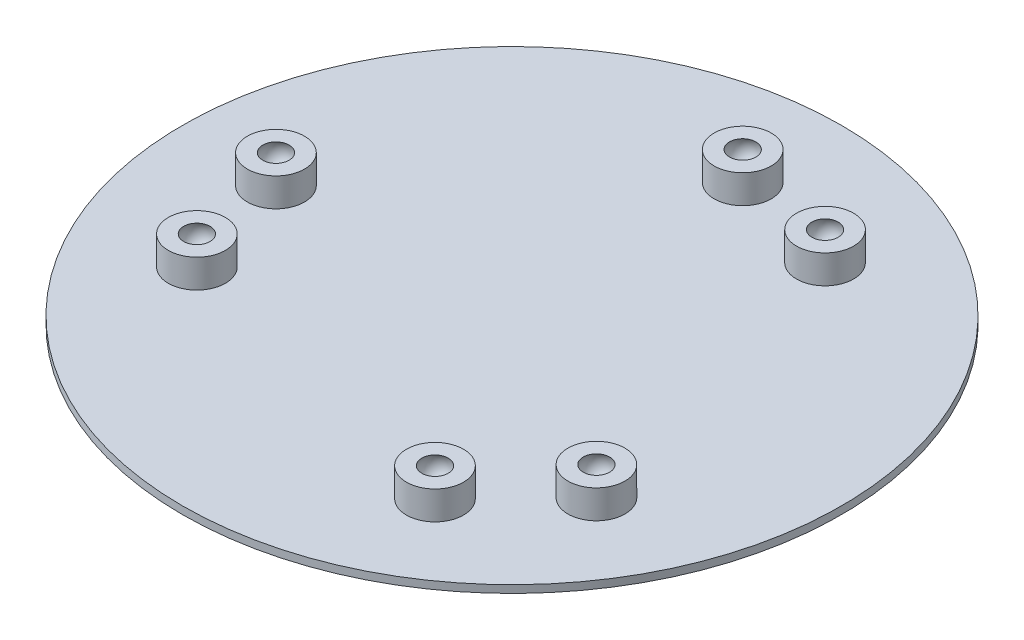
ISO-10303-21;
HEADER;
FILE_DESCRIPTION(('STEP AP214'),'2;1');
FILE_NAME('part.step','',(''),(''),'','','');
FILE_SCHEMA(('AUTOMOTIVE_DESIGN { 1 0 10303 214 1 1 1 1 }'));
ENDSEC;
DATA;
#1=APPLICATION_CONTEXT('core data for automotive mechanical design processes');
#2=APPLICATION_PROTOCOL_DEFINITION('international standard','automotive_design',2000,#1);
#3=PRODUCT_CONTEXT('',#1,'mechanical');
#4=PRODUCT('Part','Part','',(#3));
#5=PRODUCT_RELATED_PRODUCT_CATEGORY('part','',(#4));
#6=PRODUCT_DEFINITION_FORMATION('','',#4);
#7=PRODUCT_DEFINITION_CONTEXT('part definition',#1,'design');
#8=PRODUCT_DEFINITION('design','',#6,#7);
#9=PRODUCT_DEFINITION_SHAPE('','',#8);
#10=(LENGTH_UNIT() NAMED_UNIT(*) SI_UNIT(.MILLI.,.METRE.));
#11=(NAMED_UNIT(*) PLANE_ANGLE_UNIT() SI_UNIT($,.RADIAN.));
#12=(NAMED_UNIT(*) SI_UNIT($,.STERADIAN.) SOLID_ANGLE_UNIT());
#13=UNCERTAINTY_MEASURE_WITH_UNIT(LENGTH_MEASURE(1.E-05),#10,'distance_accuracy_value','');
#14=(GEOMETRIC_REPRESENTATION_CONTEXT(3) GLOBAL_UNCERTAINTY_ASSIGNED_CONTEXT((#13)) GLOBAL_UNIT_ASSIGNED_CONTEXT((#10,
#11,#12)) REPRESENTATION_CONTEXT('',''));
#15=CARTESIAN_POINT('',(0.,0.,0.));
#16=DIRECTION('',(0.,0.,1.));
#17=DIRECTION('',(1.,0.,0.));
#18=AXIS2_PLACEMENT_3D('',#15,#16,#17);
#19=CARTESIAN_POINT('',(0.,-20.,0.));
#20=DIRECTION('',(0.,1.,0.));
#21=DIRECTION('',(0.,0.,1.));
#22=AXIS2_PLACEMENT_3D('',#19,#20,#21);
#23=CYLINDRICAL_SURFACE('',#22,866.025405);
#24=CARTESIAN_POINT('',(0.,-20.,0.));
#25=DIRECTION('',(0.,1.,0.));
#26=DIRECTION('',(0.,0.,1.));
#27=AXIS2_PLACEMENT_3D('',#24,#25,#26);
#28=CIRCLE('',#27,866.025405);
#29=CARTESIAN_POINT('',(0.,-20.,866.025405));
#30=VERTEX_POINT('',#29);
#31=EDGE_CURVE('E11',#30,#30,#28,.T.);
#32=ORIENTED_EDGE('',*,*,#31,.T.);
#33=EDGE_LOOP('',(#32));
#34=FACE_BOUND('',#33,.T.);
#35=CARTESIAN_POINT('',(0.,0.,0.));
#36=DIRECTION('',(0.,1.,0.));
#37=DIRECTION('',(0.,0.,1.));
#38=AXIS2_PLACEMENT_3D('',#35,#36,#37);
#39=CIRCLE('',#38,866.025405);
#40=CARTESIAN_POINT('',(0.,0.,866.025405));
#41=VERTEX_POINT('',#40);
#42=EDGE_CURVE('E44',#41,#41,#39,.T.);
#43=ORIENTED_EDGE('',*,*,#42,.F.);
#44=EDGE_LOOP('',(#43));
#45=FACE_BOUND('',#44,.T.);
#46=ADVANCED_FACE('F41',(#34,#45),#23,.T.);
#47=CARTESIAN_POINT('',(0.,-20.,0.));
#48=DIRECTION('',(0.,1.,0.));
#49=DIRECTION('',(0.,0.,1.));
#50=AXIS2_PLACEMENT_3D('',#47,#48,#49);
#51=PLANE('',#50);
#52=ORIENTED_EDGE('',*,*,#31,.F.);
#53=EDGE_LOOP('',(#52));
#54=FACE_BOUND('',#53,.T.);
#55=ADVANCED_FACE('F143',(#54),#51,.F.);
#56=CARTESIAN_POINT('',(0.,0.,0.));
#57=DIRECTION('',(0.,1.,0.));
#58=DIRECTION('',(0.,0.,1.));
#59=AXIS2_PLACEMENT_3D('',#56,#57,#58);
#60=PLANE('',#59);
#61=CARTESIAN_POINT('',(-606.049929050178,0.,14.2648003782662));
#62=DIRECTION('',(0.,1.,0.));
#63=DIRECTION('',(0.,0.,1.));
#64=AXIS2_PLACEMENT_3D('',#61,#62,#63);
#65=CIRCLE('',#64,74.9999999999999);
#66=CARTESIAN_POINT('',(-606.049929050178,0.,89.2648003782662));
#67=VERTEX_POINT('',#66);
#68=EDGE_CURVE('E75',#67,#67,#65,.T.);
#69=ORIENTED_EDGE('',*,*,#68,.F.);
#70=EDGE_LOOP('',(#69));
#71=FACE_BOUND('',#70,.T.);
#72=CARTESIAN_POINT('',(-525.000000736815,0.,303.108891750063));
#73=DIRECTION('',(0.,1.,0.));
#74=DIRECTION('',(0.,0.,1.));
#75=AXIS2_PLACEMENT_3D('',#72,#73,#74);
#76=CIRCLE('',#75,75.);
#77=CARTESIAN_POINT('',(-525.000000736815,0.,378.108891750063));
#78=VERTEX_POINT('',#77);
#79=EDGE_CURVE('E71',#78,#78,#76,.T.);
#80=ORIENTED_EDGE('',*,*,#79,.F.);
#81=EDGE_LOOP('',(#80));
#82=FACE_BOUND('',#81,.T.);
#83=CARTESIAN_POINT('',(315.378644032661,0.,517.72223433014));
#84=DIRECTION('',(0.,1.,0.));
#85=DIRECTION('',(0.,0.,1.));
#86=AXIS2_PLACEMENT_3D('',#83,#84,#85);
#87=CIRCLE('',#86,75.);
#88=CARTESIAN_POINT('',(315.378644032661,0.,592.72223433014));
#89=VERTEX_POINT('',#88);
#90=EDGE_CURVE('E67',#89,#89,#87,.T.);
#91=ORIENTED_EDGE('',*,*,#90,.F.);
#92=EDGE_LOOP('',(#91));
#93=FACE_BOUND('',#92,.T.);
#94=CARTESIAN_POINT('',(525.000000736989,0.,303.108891749962));
#95=DIRECTION('',(0.,1.,0.));
#96=DIRECTION('',(0.,0.,1.));
#97=AXIS2_PLACEMENT_3D('',#94,#95,#96);
#98=CIRCLE('',#97,75.);
#99=CARTESIAN_POINT('',(525.000000736989,0.,378.108891749962));
#100=VERTEX_POINT('',#99);
#101=EDGE_CURVE('E63',#100,#100,#98,.T.);
#102=ORIENTED_EDGE('',*,*,#101,.F.);
#103=EDGE_LOOP('',(#102));
#104=FACE_BOUND('',#103,.T.);
#105=CARTESIAN_POINT('',(290.671285017691,0.,-531.987034708382));
#106=DIRECTION('',(0.,1.,0.));
#107=DIRECTION('',(0.,0.,1.));
#108=AXIS2_PLACEMENT_3D('',#105,#106,#107);
#109=CIRCLE('',#108,75.);
#110=CARTESIAN_POINT('',(290.671285017691,0.,-456.987034708382));
#111=VERTEX_POINT('',#110);
#112=EDGE_CURVE('E59',#111,#111,#109,.T.);
#113=ORIENTED_EDGE('',*,*,#112,.F.);
#114=EDGE_LOOP('',(#113));
#115=FACE_BOUND('',#114,.T.);
#116=CARTESIAN_POINT('',(0.,0.,-606.2177835));
#117=DIRECTION('',(0.,1.,0.));
#118=DIRECTION('',(0.,0.,1.));
#119=AXIS2_PLACEMENT_3D('',#116,#117,#118);
#120=CIRCLE('',#119,75.);
#121=CARTESIAN_POINT('',(0.,0.,-531.2177835));
#122=VERTEX_POINT('',#121);
#123=EDGE_CURVE('E54',#122,#122,#120,.T.);
#124=ORIENTED_EDGE('',*,*,#123,.F.);
#125=EDGE_LOOP('',(#124));
#126=FACE_BOUND('',#125,.T.);
#127=ORIENTED_EDGE('',*,*,#42,.T.);
#128=EDGE_LOOP('',(#127));
#129=FACE_BOUND('',#128,.T.);
#130=ADVANCED_FACE('F147',(#71,#82,#93,#104,#115,#126,#129),#60,.T.);
#131=CARTESIAN_POINT('',(0.,55.0000000000001,-606.2177835));
#132=DIRECTION('',(0.,1.,0.));
#133=DIRECTION('',(0.939626359849781,0.,-0.342202138911273));
#134=AXIS2_PLACEMENT_3D('',#131,#132,#133);
#135=SPHERICAL_SURFACE('',#134,40.);
#136=CARTESIAN_POINT('',(0.,75.,-606.2177835));
#137=DIRECTION('',(0.,1.,0.));
#138=DIRECTION('',(-0.939626359849781,0.,0.342202138911273));
#139=AXIS2_PLACEMENT_3D('',#136,#137,#138);
#140=CIRCLE('',#139,34.6410161513776);
#141=CARTESIAN_POINT('',(-32.5496119078164,75.,-594.363553678939));
#142=VERTEX_POINT('',#141);
#143=EDGE_CURVE('E79',#142,#142,#140,.T.);
#144=ORIENTED_EDGE('',*,*,#143,.T.);
#145=EDGE_LOOP('',(#144));
#146=FACE_BOUND('',#145,.T.);
#147=ADVANCED_FACE('F154',(#146),#135,.F.);
#148=CARTESIAN_POINT('',(70.4719769887336,75.,-631.882943918345));
#149=DIRECTION('',(0.,-1.,0.));
#150=DIRECTION('',(0.939626359849781,0.,-0.342202138911273));
#151=AXIS2_PLACEMENT_3D('',#148,#149,#150);
#152=PLANE('',#151);
#153=ORIENTED_EDGE('',*,*,#143,.F.);
#154=EDGE_LOOP('',(#153));
#155=FACE_BOUND('',#154,.T.);
#156=CARTESIAN_POINT('',(0.,75.,-606.2177835));
#157=DIRECTION('',(0.,1.,0.));
#158=DIRECTION('',(-0.939626359849781,0.,0.342202138911273));
#159=AXIS2_PLACEMENT_3D('',#156,#157,#158);
#160=CIRCLE('',#159,75.);
#161=CARTESIAN_POINT('',(-70.4719769887336,75.,-580.552623081655));
#162=VERTEX_POINT('',#161);
#163=EDGE_CURVE('E83',#162,#162,#160,.T.);
#164=ORIENTED_EDGE('',*,*,#163,.T.);
#165=EDGE_LOOP('',(#164));
#166=FACE_BOUND('',#165,.T.);
#167=ADVANCED_FACE('F159',(#155,#166),#152,.F.);
#168=CARTESIAN_POINT('',(0.,76.4620325892797,-606.2177835));
#169=DIRECTION('',(0.,1.,0.));
#170=DIRECTION('',(-0.939626359849781,0.,0.342202138911273));
#171=AXIS2_PLACEMENT_3D('',#168,#169,#170);
#172=CYLINDRICAL_SURFACE('',#171,75.);
#173=ORIENTED_EDGE('',*,*,#123,.T.);
#174=EDGE_LOOP('',(#173));
#175=FACE_BOUND('',#174,.T.);
#176=ORIENTED_EDGE('',*,*,#163,.F.);
#177=EDGE_LOOP('',(#176));
#178=FACE_BOUND('',#177,.T.);
#179=ADVANCED_FACE('F167',(#175,#178),#172,.T.);
#180=CARTESIAN_POINT('',(290.671285017691,55.0000000000001,-531.987034708382));
#181=DIRECTION('',(0.,1.,0.));
#182=DIRECTION('',(0.946641848389038,0.,-0.322287466213915));
#183=AXIS2_PLACEMENT_3D('',#180,#181,#182);
#184=SPHERICAL_SURFACE('',#183,40.);
#185=CARTESIAN_POINT('',(290.671285017691,75.,-531.987034708382));
#186=DIRECTION('',(0.,1.,0.));
#187=DIRECTION('',(-0.946641848389038,0.,0.322287466213915));
#188=AXIS2_PLACEMENT_3D('',#185,#186,#187);
#189=CIRCLE('',#188,34.6410161513776);
#190=CARTESIAN_POINT('',(257.878649458076,75.,-520.822669385879));
#191=VERTEX_POINT('',#190);
#192=EDGE_CURVE('E91',#191,#191,#189,.T.);
#193=ORIENTED_EDGE('',*,*,#192,.T.);
#194=EDGE_LOOP('',(#193));
#195=FACE_BOUND('',#194,.T.);
#196=ADVANCED_FACE('F171',(#195),#184,.F.);
#197=CARTESIAN_POINT('',(361.669423646869,75.,-556.158594674426));
#198=DIRECTION('',(0.,-1.,0.));
#199=DIRECTION('',(0.946641848389038,0.,-0.322287466213915));
#200=AXIS2_PLACEMENT_3D('',#197,#198,#199);
#201=PLANE('',#200);
#202=ORIENTED_EDGE('',*,*,#192,.F.);
#203=EDGE_LOOP('',(#202));
#204=FACE_BOUND('',#203,.T.);
#205=CARTESIAN_POINT('',(290.671285017691,75.,-531.987034708382));
#206=DIRECTION('',(0.,1.,0.));
#207=DIRECTION('',(-0.946641848389038,0.,0.322287466213915));
#208=AXIS2_PLACEMENT_3D('',#205,#206,#207);
#209=CIRCLE('',#208,75.);
#210=CARTESIAN_POINT('',(219.673146388513,75.,-507.815474742338));
#211=VERTEX_POINT('',#210);
#212=EDGE_CURVE('E87',#211,#211,#209,.T.);
#213=ORIENTED_EDGE('',*,*,#212,.T.);
#214=EDGE_LOOP('',(#213));
#215=FACE_BOUND('',#214,.T.);
#216=ADVANCED_FACE('F177',(#204,#215),#201,.F.);
#217=CARTESIAN_POINT('',(290.671285017691,76.4620325892797,-531.987034708382));
#218=DIRECTION('',(0.,1.,0.));
#219=DIRECTION('',(-0.946641848389038,0.,0.322287466213915));
#220=AXIS2_PLACEMENT_3D('',#217,#218,#219);
#221=CYLINDRICAL_SURFACE('',#220,75.);
#222=ORIENTED_EDGE('',*,*,#112,.T.);
#223=EDGE_LOOP('',(#222));
#224=FACE_BOUND('',#223,.T.);
#225=ORIENTED_EDGE('',*,*,#212,.F.);
#226=EDGE_LOOP('',(#225));
#227=FACE_BOUND('',#226,.T.);
#228=ADVANCED_FACE('F173',(#224,#227),#221,.T.);
#229=CARTESIAN_POINT('',(315.378644032661,55.0000000000001,517.72223433014));
#230=DIRECTION('',(0.,1.,0.));
#231=DIRECTION('',(-0.0298698292370691,0.,-0.999553797102161));
#232=AXIS2_PLACEMENT_3D('',#229,#230,#231);
#233=SPHERICAL_SURFACE('',#232,40.);
#234=CARTESIAN_POINT('',(315.378644032661,75.,517.72223433014));
#235=DIRECTION('',(0.,1.,0.));
#236=DIRECTION('',(0.0298698292370691,0.,0.999553797102161));
#237=AXIS2_PLACEMENT_3D('',#234,#235,#236);
#238=CIRCLE('',#237,34.6410161513776);
#239=CARTESIAN_POINT('',(316.413365269702,75.,552.347793559727));
#240=VERTEX_POINT('',#239);
#241=EDGE_CURVE('E99',#240,#240,#238,.T.);
#242=ORIENTED_EDGE('',*,*,#241,.T.);
#243=EDGE_LOOP('',(#242));
#244=FACE_BOUND('',#243,.T.);
#245=ADVANCED_FACE('F176',(#244),#233,.F.);
#246=CARTESIAN_POINT('',(313.138406839881,75.,442.755699547478));
#247=DIRECTION('',(0.,-1.,0.));
#248=DIRECTION('',(-0.0298698292370691,0.,-0.999553797102161));
#249=AXIS2_PLACEMENT_3D('',#246,#247,#248);
#250=PLANE('',#249);
#251=ORIENTED_EDGE('',*,*,#241,.F.);
#252=EDGE_LOOP('',(#251));
#253=FACE_BOUND('',#252,.T.);
#254=CARTESIAN_POINT('',(315.378644032661,75.,517.72223433014));
#255=DIRECTION('',(0.,1.,0.));
#256=DIRECTION('',(0.0298698292370691,0.,0.999553797102161));
#257=AXIS2_PLACEMENT_3D('',#254,#255,#256);
#258=CIRCLE('',#257,75.);
#259=CARTESIAN_POINT('',(317.618881225441,75.,592.688769112802));
#260=VERTEX_POINT('',#259);
#261=EDGE_CURVE('E95',#260,#260,#258,.T.);
#262=ORIENTED_EDGE('',*,*,#261,.T.);
#263=EDGE_LOOP('',(#262));
#264=FACE_BOUND('',#263,.T.);
#265=ADVANCED_FACE('F189',(#253,#264),#250,.F.);
#266=CARTESIAN_POINT('',(315.378644032661,76.4620325892797,517.72223433014));
#267=DIRECTION('',(0.,1.,0.));
#268=DIRECTION('',(0.0298698292370691,0.,0.999553797102161));
#269=AXIS2_PLACEMENT_3D('',#266,#267,#268);
#270=CYLINDRICAL_SURFACE('',#269,75.);
#271=ORIENTED_EDGE('',*,*,#90,.T.);
#272=EDGE_LOOP('',(#271));
#273=FACE_BOUND('',#272,.T.);
#274=ORIENTED_EDGE('',*,*,#261,.F.);
#275=EDGE_LOOP('',(#274));
#276=FACE_BOUND('',#275,.T.);
#277=ADVANCED_FACE('F185',(#273,#276),#270,.T.);
#278=CARTESIAN_POINT('',(-525.000000736815,55.0000000000001,303.108891750063));
#279=DIRECTION('',(0.,1.,0.));
#280=DIRECTION('',(0.441937559526535,0.,-0.897045814593508));
#281=AXIS2_PLACEMENT_3D('',#278,#279,#280);
#282=SPHERICAL_SURFACE('',#281,40.);
#283=CARTESIAN_POINT('',(-525.000000736815,75.,303.108891750063));
#284=DIRECTION('',(0.,1.,0.));
#285=DIRECTION('',(-0.441937559526535,0.,0.897045814593508));
#286=AXIS2_PLACEMENT_3D('',#283,#284,#285);
#287=CIRCLE('',#286,34.6410161513776);
#288=CARTESIAN_POINT('',(-540.309166874274,75.,334.183470301922));
#289=VERTEX_POINT('',#288);
#290=EDGE_CURVE('E107',#289,#289,#287,.T.);
#291=ORIENTED_EDGE('',*,*,#290,.T.);
#292=EDGE_LOOP('',(#291));
#293=FACE_BOUND('',#292,.T.);
#294=ADVANCED_FACE('F188',(#293),#282,.F.);
#295=CARTESIAN_POINT('',(-491.854683772325,75.,235.83045565555));
#296=DIRECTION('',(0.,-1.,0.));
#297=DIRECTION('',(0.441937559526535,0.,-0.897045814593508));
#298=AXIS2_PLACEMENT_3D('',#295,#296,#297);
#299=PLANE('',#298);
#300=ORIENTED_EDGE('',*,*,#290,.F.);
#301=EDGE_LOOP('',(#300));
#302=FACE_BOUND('',#301,.T.);
#303=CARTESIAN_POINT('',(-525.000000736815,75.,303.108891750063));
#304=DIRECTION('',(0.,1.,0.));
#305=DIRECTION('',(-0.441937559526535,0.,0.897045814593508));
#306=AXIS2_PLACEMENT_3D('',#303,#304,#305);
#307=CIRCLE('',#306,75.);
#308=CARTESIAN_POINT('',(-558.145317701305,75.,370.387327844576));
#309=VERTEX_POINT('',#308);
#310=EDGE_CURVE('E103',#309,#309,#307,.T.);
#311=ORIENTED_EDGE('',*,*,#310,.T.);
#312=EDGE_LOOP('',(#311));
#313=FACE_BOUND('',#312,.T.);
#314=ADVANCED_FACE('F201',(#302,#313),#299,.F.);
#315=CARTESIAN_POINT('',(-525.000000736815,76.4620325892796,303.108891750063));
#316=DIRECTION('',(0.,1.,0.));
#317=DIRECTION('',(-0.441937559526535,0.,0.897045814593508));
#318=AXIS2_PLACEMENT_3D('',#315,#316,#317);
#319=CYLINDRICAL_SURFACE('',#318,75.);
#320=ORIENTED_EDGE('',*,*,#79,.T.);
#321=EDGE_LOOP('',(#320));
#322=FACE_BOUND('',#321,.T.);
#323=ORIENTED_EDGE('',*,*,#310,.F.);
#324=EDGE_LOOP('',(#323));
#325=FACE_BOUND('',#324,.T.);
#326=ADVANCED_FACE('F197',(#322,#325),#319,.T.);
#327=CARTESIAN_POINT('',(-606.049929050178,55.0000000000001,14.2648003782662));
#328=DIRECTION('',(0.,1.,0.));
#329=DIRECTION('',(0.939626359849781,0.,-0.342202138911273));
#330=AXIS2_PLACEMENT_3D('',#327,#328,#329);
#331=SPHERICAL_SURFACE('',#330,40.);
#332=CARTESIAN_POINT('',(-606.049929050178,75.,14.2648003782662));
#333=DIRECTION('',(0.,1.,0.));
#334=DIRECTION('',(-0.939626359849781,0.,0.342202138911273));
#335=AXIS2_PLACEMENT_3D('',#332,#333,#334);
#336=CIRCLE('',#335,34.6410161513776);
#337=CARTESIAN_POINT('',(-638.599540957994,75.,26.1190301993276));
#338=VERTEX_POINT('',#337);
#339=EDGE_CURVE('E115',#338,#338,#336,.T.);
#340=ORIENTED_EDGE('',*,*,#339,.T.);
#341=EDGE_LOOP('',(#340));
#342=FACE_BOUND('',#341,.T.);
#343=ADVANCED_FACE('F200',(#342),#331,.F.);
#344=CARTESIAN_POINT('',(-535.577952061445,75.,-11.4003600400792));
#345=DIRECTION('',(0.,-1.,0.));
#346=DIRECTION('',(0.939626359849781,0.,-0.342202138911273));
#347=AXIS2_PLACEMENT_3D('',#344,#345,#346);
#348=PLANE('',#347);
#349=ORIENTED_EDGE('',*,*,#339,.F.);
#350=EDGE_LOOP('',(#349));
#351=FACE_BOUND('',#350,.T.);
#352=CARTESIAN_POINT('',(-606.049929050178,75.,14.2648003782662));
#353=DIRECTION('',(0.,1.,0.));
#354=DIRECTION('',(-0.939626359849781,0.,0.342202138911273));
#355=AXIS2_PLACEMENT_3D('',#352,#353,#354);
#356=CIRCLE('',#355,75.);
#357=CARTESIAN_POINT('',(-676.521906038912,75.,39.9299607966117));
#358=VERTEX_POINT('',#357);
#359=EDGE_CURVE('E111',#358,#358,#356,.T.);
#360=ORIENTED_EDGE('',*,*,#359,.T.);
#361=EDGE_LOOP('',(#360));
#362=FACE_BOUND('',#361,.T.);
#363=ADVANCED_FACE('F212',(#351,#362),#348,.F.);
#364=CARTESIAN_POINT('',(-606.049929050178,76.4620325892797,14.2648003782662));
#365=DIRECTION('',(0.,1.,0.));
#366=DIRECTION('',(-0.939626359849781,0.,0.342202138911273));
#367=AXIS2_PLACEMENT_3D('',#364,#365,#366);
#368=CYLINDRICAL_SURFACE('',#367,75.);
#369=ORIENTED_EDGE('',*,*,#68,.T.);
#370=EDGE_LOOP('',(#369));
#371=FACE_BOUND('',#370,.T.);
#372=ORIENTED_EDGE('',*,*,#359,.F.);
#373=EDGE_LOOP('',(#372));
#374=FACE_BOUND('',#373,.T.);
#375=ADVANCED_FACE('F209',(#371,#374),#368,.T.);
#376=CARTESIAN_POINT('',(525.000000736989,55.0000000000001,303.108891749962));
#377=DIRECTION('',(0.,1.,0.));
#378=DIRECTION('',(-0.200050417992493,0.,-0.97978560423239));
#379=AXIS2_PLACEMENT_3D('',#376,#377,#378);
#380=SPHERICAL_SURFACE('',#379,40.);
#381=CARTESIAN_POINT('',(525.000000736989,75.,303.108891749962));
#382=DIRECTION('',(0.,1.,0.));
#383=DIRECTION('',(0.200050417992493,0.,0.97978560423239));
#384=AXIS2_PLACEMENT_3D('',#381,#382,#383);
#385=CIRCLE('',#384,34.6410161513776);
#386=CARTESIAN_POINT('',(531.929950497757,75.,337.049660691063));
#387=VERTEX_POINT('',#386);
#388=EDGE_CURVE('E122',#387,#387,#385,.T.);
#389=ORIENTED_EDGE('',*,*,#388,.T.);
#390=EDGE_LOOP('',(#389));
#391=FACE_BOUND('',#390,.T.);
#392=ADVANCED_FACE('F127',(#391),#380,.F.);
#393=CARTESIAN_POINT('',(509.996219387552,75.,229.624971432533));
#394=DIRECTION('',(0.,-1.,0.));
#395=DIRECTION('',(-0.200050417992493,0.,-0.97978560423239));
#396=AXIS2_PLACEMENT_3D('',#393,#394,#395);
#397=PLANE('',#396);
#398=ORIENTED_EDGE('',*,*,#388,.F.);
#399=EDGE_LOOP('',(#398));
#400=FACE_BOUND('',#399,.T.);
#401=CARTESIAN_POINT('',(525.000000736989,75.,303.108891749962));
#402=DIRECTION('',(0.,1.,0.));
#403=DIRECTION('',(0.200050417992493,0.,0.97978560423239));
#404=AXIS2_PLACEMENT_3D('',#401,#402,#403);
#405=CIRCLE('',#404,75.);
#406=CARTESIAN_POINT('',(540.003782086426,75.,376.592812067391));
#407=VERTEX_POINT('',#406);
#408=EDGE_CURVE('E118',#407,#407,#405,.T.);
#409=ORIENTED_EDGE('',*,*,#408,.T.);
#410=EDGE_LOOP('',(#409));
#411=FACE_BOUND('',#410,.T.);
#412=ADVANCED_FACE('F129',(#400,#411),#397,.F.);
#413=CARTESIAN_POINT('',(525.000000736989,76.4620325892797,303.108891749962));
#414=DIRECTION('',(0.,1.,0.));
#415=DIRECTION('',(0.200050417992493,0.,0.97978560423239));
#416=AXIS2_PLACEMENT_3D('',#413,#414,#415);
#417=CYLINDRICAL_SURFACE('',#416,75.);
#418=ORIENTED_EDGE('',*,*,#101,.T.);
#419=EDGE_LOOP('',(#418));
#420=FACE_BOUND('',#419,.T.);
#421=ORIENTED_EDGE('',*,*,#408,.F.);
#422=EDGE_LOOP('',(#421));
#423=FACE_BOUND('',#422,.T.);
#424=ADVANCED_FACE('F132',(#420,#423),#417,.T.);
#425=CLOSED_SHELL('',(#46,#55,#130,#147,#167,#179,#196,#216,#228,#245,#265,#277,#294,#314,#326,
#343,#363,#375,#392,#412,#424));
#426=MANIFOLD_SOLID_BREP('B2',#425);
#427=ADVANCED_BREP_SHAPE_REPRESENTATION('',(#18,#426),#14);
#428=SHAPE_DEFINITION_REPRESENTATION(#9,#427);
ENDSEC;
END-ISO-10303-21;
